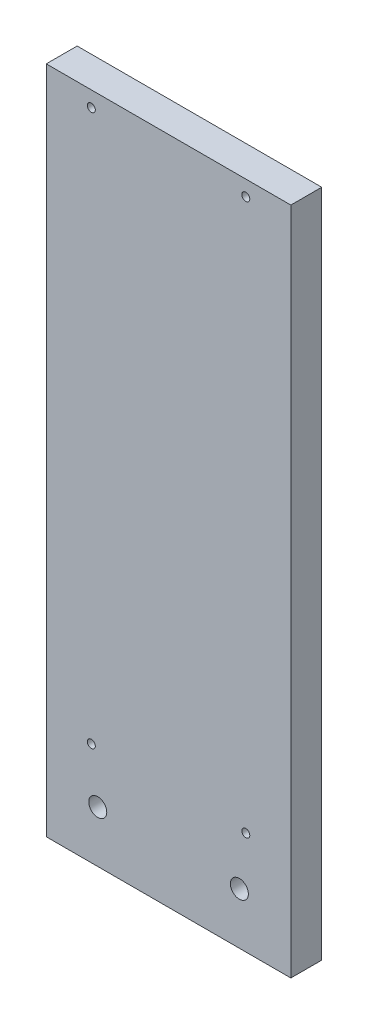
ISO-10303-21;
HEADER;
FILE_DESCRIPTION(('STEP AP214'),'2;1');
FILE_NAME('part.step','',(''),(''),'','','');
FILE_SCHEMA(('AUTOMOTIVE_DESIGN { 1 0 10303 214 1 1 1 1 }'));
ENDSEC;
DATA;
#1=APPLICATION_CONTEXT('core data for automotive mechanical design processes');
#2=APPLICATION_PROTOCOL_DEFINITION('international standard','automotive_design',2000,#1);
#3=PRODUCT_CONTEXT('',#1,'mechanical');
#4=PRODUCT('Part','Part','',(#3));
#5=PRODUCT_RELATED_PRODUCT_CATEGORY('part','',(#4));
#6=PRODUCT_DEFINITION_FORMATION('','',#4);
#7=PRODUCT_DEFINITION_CONTEXT('part definition',#1,'design');
#8=PRODUCT_DEFINITION('design','',#6,#7);
#9=PRODUCT_DEFINITION_SHAPE('','',#8);
#10=(LENGTH_UNIT() NAMED_UNIT(*) SI_UNIT(.MILLI.,.METRE.));
#11=(NAMED_UNIT(*) PLANE_ANGLE_UNIT() SI_UNIT($,.RADIAN.));
#12=(NAMED_UNIT(*) SI_UNIT($,.STERADIAN.) SOLID_ANGLE_UNIT());
#13=UNCERTAINTY_MEASURE_WITH_UNIT(LENGTH_MEASURE(1.E-05),#10,'distance_accuracy_value','');
#14=(GEOMETRIC_REPRESENTATION_CONTEXT(3) GLOBAL_UNCERTAINTY_ASSIGNED_CONTEXT((#13)) GLOBAL_UNIT_ASSIGNED_CONTEXT((#10,
#11,#12)) REPRESENTATION_CONTEXT('',''));
#15=CARTESIAN_POINT('',(0.,0.,0.));
#16=DIRECTION('',(0.,0.,1.));
#17=DIRECTION('',(1.,0.,0.));
#18=AXIS2_PLACEMENT_3D('',#15,#16,#17);
#19=CARTESIAN_POINT('',(47.5,130.,12.));
#20=DIRECTION('',(-1.,0.,0.));
#21=DIRECTION('',(0.,-1.,0.));
#22=AXIS2_PLACEMENT_3D('',#19,#20,#21);
#23=PLANE('',#22);
#24=DIRECTION('',(0.,1.,0.));
#25=VECTOR('',#24,1.);
#26=CARTESIAN_POINT('',(47.5,130.,0.));
#27=LINE('',#26,#25);
#28=CARTESIAN_POINT('',(47.5,-130.,0.));
#29=VERTEX_POINT('',#28);
#30=CARTESIAN_POINT('',(47.5,130.,0.));
#31=VERTEX_POINT('',#30);
#32=EDGE_CURVE('E96',#29,#31,#27,.T.);
#33=ORIENTED_EDGE('',*,*,#32,.T.);
#34=DIRECTION('',(0.,0.,-1.));
#35=VECTOR('',#34,1.);
#36=CARTESIAN_POINT('',(47.5,130.,12.));
#37=LINE('',#36,#35);
#38=CARTESIAN_POINT('',(47.5,130.,12.));
#39=VERTEX_POINT('',#38);
#40=EDGE_CURVE('E11',#39,#31,#37,.T.);
#41=ORIENTED_EDGE('',*,*,#40,.F.);
#42=DIRECTION('',(0.,1.,0.));
#43=VECTOR('',#42,1.);
#44=CARTESIAN_POINT('',(47.5,130.,12.));
#45=LINE('',#44,#43);
#46=CARTESIAN_POINT('',(47.5,-130.,12.));
#47=VERTEX_POINT('',#46);
#48=EDGE_CURVE('E84',#47,#39,#45,.T.);
#49=ORIENTED_EDGE('',*,*,#48,.F.);
#50=DIRECTION('',(0.,0.,-1.));
#51=VECTOR('',#50,1.);
#52=CARTESIAN_POINT('',(47.5,-130.,12.));
#53=LINE('',#52,#51);
#54=EDGE_CURVE('E92',#47,#29,#53,.T.);
#55=ORIENTED_EDGE('',*,*,#54,.T.);
#56=EDGE_LOOP('',(#33,#41,#49,#55));
#57=FACE_BOUND('',#56,.T.);
#58=ADVANCED_FACE('F33',(#57),#23,.F.);
#59=CARTESIAN_POINT('',(-47.5,130.,12.));
#60=DIRECTION('',(0.,-1.,0.));
#61=DIRECTION('',(0.,0.,-1.));
#62=AXIS2_PLACEMENT_3D('',#59,#60,#61);
#63=PLANE('',#62);
#64=DIRECTION('',(-1.,0.,0.));
#65=VECTOR('',#64,1.);
#66=CARTESIAN_POINT('',(-47.5,130.,0.));
#67=LINE('',#66,#65);
#68=CARTESIAN_POINT('',(-47.5,130.,0.));
#69=VERTEX_POINT('',#68);
#70=EDGE_CURVE('E88',#31,#69,#67,.T.);
#71=ORIENTED_EDGE('',*,*,#70,.T.);
#72=DIRECTION('',(0.,0.,-1.));
#73=VECTOR('',#72,1.);
#74=CARTESIAN_POINT('',(-47.5,130.,12.));
#75=LINE('',#74,#73);
#76=CARTESIAN_POINT('',(-47.5,130.,12.));
#77=VERTEX_POINT('',#76);
#78=EDGE_CURVE('E41',#77,#69,#75,.T.);
#79=ORIENTED_EDGE('',*,*,#78,.F.);
#80=DIRECTION('',(-1.,0.,0.));
#81=VECTOR('',#80,1.);
#82=CARTESIAN_POINT('',(-47.5,130.,12.));
#83=LINE('',#82,#81);
#84=EDGE_CURVE('E79',#39,#77,#83,.T.);
#85=ORIENTED_EDGE('',*,*,#84,.F.);
#86=ORIENTED_EDGE('',*,*,#40,.T.);
#87=EDGE_LOOP('',(#71,#79,#85,#86));
#88=FACE_BOUND('',#87,.T.);
#89=ADVANCED_FACE('F87',(#88),#63,.F.);
#90=CARTESIAN_POINT('',(-47.5,130.,12.));
#91=DIRECTION('',(1.,0.,0.));
#92=DIRECTION('',(0.,1.,0.));
#93=AXIS2_PLACEMENT_3D('',#90,#91,#92);
#94=PLANE('',#93);
#95=DIRECTION('',(0.,-1.,0.));
#96=VECTOR('',#95,1.);
#97=CARTESIAN_POINT('',(-47.5,130.,0.));
#98=LINE('',#97,#96);
#99=CARTESIAN_POINT('',(-47.5,-130.,0.));
#100=VERTEX_POINT('',#99);
#101=EDGE_CURVE('E66',#69,#100,#98,.T.);
#102=ORIENTED_EDGE('',*,*,#101,.T.);
#103=DIRECTION('',(0.,0.,-1.));
#104=VECTOR('',#103,1.);
#105=CARTESIAN_POINT('',(-47.5,-130.,12.));
#106=LINE('',#105,#104);
#107=CARTESIAN_POINT('',(-47.5,-130.,12.));
#108=VERTEX_POINT('',#107);
#109=EDGE_CURVE('E89',#108,#100,#106,.T.);
#110=ORIENTED_EDGE('',*,*,#109,.F.);
#111=DIRECTION('',(0.,-1.,0.));
#112=VECTOR('',#111,1.);
#113=CARTESIAN_POINT('',(-47.5,130.,12.));
#114=LINE('',#113,#112);
#115=EDGE_CURVE('E82',#77,#108,#114,.T.);
#116=ORIENTED_EDGE('',*,*,#115,.F.);
#117=ORIENTED_EDGE('',*,*,#78,.T.);
#118=EDGE_LOOP('',(#102,#110,#116,#117));
#119=FACE_BOUND('',#118,.T.);
#120=ADVANCED_FACE('F90',(#119),#94,.F.);
#121=CARTESIAN_POINT('',(-47.5,-130.,12.));
#122=DIRECTION('',(0.,1.,0.));
#123=DIRECTION('',(0.,0.,1.));
#124=AXIS2_PLACEMENT_3D('',#121,#122,#123);
#125=PLANE('',#124);
#126=DIRECTION('',(1.,0.,0.));
#127=VECTOR('',#126,1.);
#128=CARTESIAN_POINT('',(-47.5,-130.,0.));
#129=LINE('',#128,#127);
#130=EDGE_CURVE('E72',#100,#29,#129,.T.);
#131=ORIENTED_EDGE('',*,*,#130,.T.);
#132=ORIENTED_EDGE('',*,*,#54,.F.);
#133=DIRECTION('',(1.,0.,0.));
#134=VECTOR('',#133,1.);
#135=CARTESIAN_POINT('',(-47.5,-130.,12.));
#136=LINE('',#135,#134);
#137=EDGE_CURVE('E49',#108,#47,#136,.T.);
#138=ORIENTED_EDGE('',*,*,#137,.F.);
#139=ORIENTED_EDGE('',*,*,#109,.T.);
#140=EDGE_LOOP('',(#131,#132,#138,#139));
#141=FACE_BOUND('',#140,.T.);
#142=ADVANCED_FACE('F104',(#141),#125,.F.);
#143=CARTESIAN_POINT('',(0.,0.,12.));
#144=DIRECTION('',(0.,0.,1.));
#145=DIRECTION('',(1.,0.,0.));
#146=AXIS2_PLACEMENT_3D('',#143,#144,#145);
#147=PLANE('',#146);
#148=CARTESIAN_POINT('',(-30.,124.,12.));
#149=DIRECTION('',(0.,0.,1.));
#150=DIRECTION('',(1.,0.,0.));
#151=AXIS2_PLACEMENT_3D('',#148,#149,#150);
#152=CIRCLE('',#151,1.55);
#153=CARTESIAN_POINT('',(-28.45,124.,12.));
#154=VERTEX_POINT('',#153);
#155=EDGE_CURVE('E140',#154,#154,#152,.T.);
#156=ORIENTED_EDGE('',*,*,#155,.F.);
#157=EDGE_LOOP('',(#156));
#158=FACE_BOUND('',#157,.T.);
#159=CARTESIAN_POINT('',(30.0000000000001,124.,12.));
#160=DIRECTION('',(0.,0.,1.));
#161=DIRECTION('',(1.,0.,0.));
#162=AXIS2_PLACEMENT_3D('',#159,#160,#161);
#163=CIRCLE('',#162,1.55);
#164=CARTESIAN_POINT('',(31.5500000000001,124.,12.));
#165=VERTEX_POINT('',#164);
#166=EDGE_CURVE('E134',#165,#165,#163,.T.);
#167=ORIENTED_EDGE('',*,*,#166,.F.);
#168=EDGE_LOOP('',(#167));
#169=FACE_BOUND('',#168,.T.);
#170=CARTESIAN_POINT('',(30.,-90.,12.));
#171=DIRECTION('',(0.,0.,1.));
#172=DIRECTION('',(1.,0.,0.));
#173=AXIS2_PLACEMENT_3D('',#170,#171,#172);
#174=CIRCLE('',#173,1.54999999999999);
#175=CARTESIAN_POINT('',(31.55,-90.,12.));
#176=VERTEX_POINT('',#175);
#177=EDGE_CURVE('E128',#176,#176,#174,.T.);
#178=ORIENTED_EDGE('',*,*,#177,.F.);
#179=EDGE_LOOP('',(#178));
#180=FACE_BOUND('',#179,.T.);
#181=CARTESIAN_POINT('',(-30.,-90.,12.));
#182=DIRECTION('',(0.,0.,1.));
#183=DIRECTION('',(1.,0.,0.));
#184=AXIS2_PLACEMENT_3D('',#181,#182,#183);
#185=CIRCLE('',#184,1.55);
#186=CARTESIAN_POINT('',(-28.45,-90.,12.));
#187=VERTEX_POINT('',#186);
#188=EDGE_CURVE('E122',#187,#187,#185,.T.);
#189=ORIENTED_EDGE('',*,*,#188,.F.);
#190=EDGE_LOOP('',(#189));
#191=FACE_BOUND('',#190,.T.);
#192=CARTESIAN_POINT('',(27.5,-110.,12.));
#193=DIRECTION('',(0.,0.,1.));
#194=DIRECTION('',(1.,0.,0.));
#195=AXIS2_PLACEMENT_3D('',#192,#193,#194);
#196=CIRCLE('',#195,3.5);
#197=CARTESIAN_POINT('',(31.,-110.,12.));
#198=VERTEX_POINT('',#197);
#199=EDGE_CURVE('E116',#198,#198,#196,.T.);
#200=ORIENTED_EDGE('',*,*,#199,.F.);
#201=EDGE_LOOP('',(#200));
#202=FACE_BOUND('',#201,.T.);
#203=CARTESIAN_POINT('',(-27.5,-110.,12.));
#204=DIRECTION('',(0.,0.,1.));
#205=DIRECTION('',(1.,0.,0.));
#206=AXIS2_PLACEMENT_3D('',#203,#204,#205);
#207=CIRCLE('',#206,3.5);
#208=CARTESIAN_POINT('',(-24.,-110.,12.));
#209=VERTEX_POINT('',#208);
#210=EDGE_CURVE('E110',#209,#209,#207,.T.);
#211=ORIENTED_EDGE('',*,*,#210,.F.);
#212=EDGE_LOOP('',(#211));
#213=FACE_BOUND('',#212,.T.);
#214=ORIENTED_EDGE('',*,*,#48,.T.);
#215=ORIENTED_EDGE('',*,*,#84,.T.);
#216=ORIENTED_EDGE('',*,*,#115,.T.);
#217=ORIENTED_EDGE('',*,*,#137,.T.);
#218=EDGE_LOOP('',(#214,#215,#216,#217));
#219=FACE_BOUND('',#218,.T.);
#220=ADVANCED_FACE('F80',(#158,#169,#180,#191,#202,#213,#219),#147,.T.);
#221=CARTESIAN_POINT('',(0.,0.,0.));
#222=DIRECTION('',(0.,0.,1.));
#223=DIRECTION('',(1.,0.,0.));
#224=AXIS2_PLACEMENT_3D('',#221,#222,#223);
#225=PLANE('',#224);
#226=CARTESIAN_POINT('',(-30.,124.,0.));
#227=DIRECTION('',(0.,0.,1.));
#228=DIRECTION('',(1.,0.,0.));
#229=AXIS2_PLACEMENT_3D('',#226,#227,#228);
#230=CIRCLE('',#229,1.55);
#231=CARTESIAN_POINT('',(-28.45,124.,0.));
#232=VERTEX_POINT('',#231);
#233=EDGE_CURVE('E137',#232,#232,#230,.T.);
#234=ORIENTED_EDGE('',*,*,#233,.T.);
#235=EDGE_LOOP('',(#234));
#236=FACE_BOUND('',#235,.T.);
#237=CARTESIAN_POINT('',(30.0000000000001,124.,0.));
#238=DIRECTION('',(0.,0.,1.));
#239=DIRECTION('',(1.,0.,0.));
#240=AXIS2_PLACEMENT_3D('',#237,#238,#239);
#241=CIRCLE('',#240,1.55);
#242=CARTESIAN_POINT('',(31.5500000000001,124.,0.));
#243=VERTEX_POINT('',#242);
#244=EDGE_CURVE('E131',#243,#243,#241,.T.);
#245=ORIENTED_EDGE('',*,*,#244,.T.);
#246=EDGE_LOOP('',(#245));
#247=FACE_BOUND('',#246,.T.);
#248=CARTESIAN_POINT('',(30.,-90.,0.));
#249=DIRECTION('',(0.,0.,1.));
#250=DIRECTION('',(1.,0.,0.));
#251=AXIS2_PLACEMENT_3D('',#248,#249,#250);
#252=CIRCLE('',#251,1.54999999999999);
#253=CARTESIAN_POINT('',(31.55,-90.,0.));
#254=VERTEX_POINT('',#253);
#255=EDGE_CURVE('E125',#254,#254,#252,.T.);
#256=ORIENTED_EDGE('',*,*,#255,.T.);
#257=EDGE_LOOP('',(#256));
#258=FACE_BOUND('',#257,.T.);
#259=CARTESIAN_POINT('',(-30.,-90.,0.));
#260=DIRECTION('',(0.,0.,1.));
#261=DIRECTION('',(1.,0.,0.));
#262=AXIS2_PLACEMENT_3D('',#259,#260,#261);
#263=CIRCLE('',#262,1.55);
#264=CARTESIAN_POINT('',(-28.45,-90.,0.));
#265=VERTEX_POINT('',#264);
#266=EDGE_CURVE('E119',#265,#265,#263,.T.);
#267=ORIENTED_EDGE('',*,*,#266,.T.);
#268=EDGE_LOOP('',(#267));
#269=FACE_BOUND('',#268,.T.);
#270=CARTESIAN_POINT('',(27.5,-110.,0.));
#271=DIRECTION('',(0.,0.,1.));
#272=DIRECTION('',(1.,0.,0.));
#273=AXIS2_PLACEMENT_3D('',#270,#271,#272);
#274=CIRCLE('',#273,3.5);
#275=CARTESIAN_POINT('',(31.,-110.,0.));
#276=VERTEX_POINT('',#275);
#277=EDGE_CURVE('E113',#276,#276,#274,.T.);
#278=ORIENTED_EDGE('',*,*,#277,.T.);
#279=EDGE_LOOP('',(#278));
#280=FACE_BOUND('',#279,.T.);
#281=CARTESIAN_POINT('',(-27.5,-110.,0.));
#282=DIRECTION('',(0.,0.,1.));
#283=DIRECTION('',(1.,0.,0.));
#284=AXIS2_PLACEMENT_3D('',#281,#282,#283);
#285=CIRCLE('',#284,3.5);
#286=CARTESIAN_POINT('',(-24.,-110.,0.));
#287=VERTEX_POINT('',#286);
#288=EDGE_CURVE('E99',#287,#287,#285,.T.);
#289=ORIENTED_EDGE('',*,*,#288,.T.);
#290=EDGE_LOOP('',(#289));
#291=FACE_BOUND('',#290,.T.);
#292=ORIENTED_EDGE('',*,*,#32,.F.);
#293=ORIENTED_EDGE('',*,*,#130,.F.);
#294=ORIENTED_EDGE('',*,*,#101,.F.);
#295=ORIENTED_EDGE('',*,*,#70,.F.);
#296=EDGE_LOOP('',(#292,#293,#294,#295));
#297=FACE_BOUND('',#296,.T.);
#298=ADVANCED_FACE('F107',(#236,#247,#258,#269,#280,#291,#297),#225,.F.);
#299=CARTESIAN_POINT('',(-27.5,-110.,0.));
#300=DIRECTION('',(0.,0.,1.));
#301=DIRECTION('',(1.,0.,0.));
#302=AXIS2_PLACEMENT_3D('',#299,#300,#301);
#303=CYLINDRICAL_SURFACE('',#302,3.5);
#304=ORIENTED_EDGE('',*,*,#288,.F.);
#305=EDGE_LOOP('',(#304));
#306=FACE_BOUND('',#305,.T.);
#307=ORIENTED_EDGE('',*,*,#210,.T.);
#308=EDGE_LOOP('',(#307));
#309=FACE_BOUND('',#308,.T.);
#310=ADVANCED_FACE('F168',(#306,#309),#303,.F.);
#311=CARTESIAN_POINT('',(27.5,-110.,0.));
#312=DIRECTION('',(0.,0.,1.));
#313=DIRECTION('',(1.,0.,0.));
#314=AXIS2_PLACEMENT_3D('',#311,#312,#313);
#315=CYLINDRICAL_SURFACE('',#314,3.5);
#316=ORIENTED_EDGE('',*,*,#277,.F.);
#317=EDGE_LOOP('',(#316));
#318=FACE_BOUND('',#317,.T.);
#319=ORIENTED_EDGE('',*,*,#199,.T.);
#320=EDGE_LOOP('',(#319));
#321=FACE_BOUND('',#320,.T.);
#322=ADVANCED_FACE('F170',(#318,#321),#315,.F.);
#323=CARTESIAN_POINT('',(-30.,-90.,0.));
#324=DIRECTION('',(0.,0.,1.));
#325=DIRECTION('',(1.,0.,0.));
#326=AXIS2_PLACEMENT_3D('',#323,#324,#325);
#327=CYLINDRICAL_SURFACE('',#326,1.55);
#328=ORIENTED_EDGE('',*,*,#266,.F.);
#329=EDGE_LOOP('',(#328));
#330=FACE_BOUND('',#329,.T.);
#331=ORIENTED_EDGE('',*,*,#188,.T.);
#332=EDGE_LOOP('',(#331));
#333=FACE_BOUND('',#332,.T.);
#334=ADVANCED_FACE('F177',(#330,#333),#327,.F.);
#335=CARTESIAN_POINT('',(30.,-90.,0.));
#336=DIRECTION('',(0.,0.,1.));
#337=DIRECTION('',(1.,0.,0.));
#338=AXIS2_PLACEMENT_3D('',#335,#336,#337);
#339=CYLINDRICAL_SURFACE('',#338,1.54999999999999);
#340=ORIENTED_EDGE('',*,*,#255,.F.);
#341=EDGE_LOOP('',(#340));
#342=FACE_BOUND('',#341,.T.);
#343=ORIENTED_EDGE('',*,*,#177,.T.);
#344=EDGE_LOOP('',(#343));
#345=FACE_BOUND('',#344,.T.);
#346=ADVANCED_FACE('F217',(#342,#345),#339,.F.);
#347=CARTESIAN_POINT('',(30.0000000000001,124.,0.));
#348=DIRECTION('',(0.,0.,1.));
#349=DIRECTION('',(1.,0.,0.));
#350=AXIS2_PLACEMENT_3D('',#347,#348,#349);
#351=CYLINDRICAL_SURFACE('',#350,1.55);
#352=ORIENTED_EDGE('',*,*,#244,.F.);
#353=EDGE_LOOP('',(#352));
#354=FACE_BOUND('',#353,.T.);
#355=ORIENTED_EDGE('',*,*,#166,.T.);
#356=EDGE_LOOP('',(#355));
#357=FACE_BOUND('',#356,.T.);
#358=ADVANCED_FACE('F151',(#354,#357),#351,.F.);
#359=CARTESIAN_POINT('',(-30.,124.,0.));
#360=DIRECTION('',(0.,0.,1.));
#361=DIRECTION('',(1.,0.,0.));
#362=AXIS2_PLACEMENT_3D('',#359,#360,#361);
#363=CYLINDRICAL_SURFACE('',#362,1.55);
#364=ORIENTED_EDGE('',*,*,#233,.F.);
#365=EDGE_LOOP('',(#364));
#366=FACE_BOUND('',#365,.T.);
#367=ORIENTED_EDGE('',*,*,#155,.T.);
#368=EDGE_LOOP('',(#367));
#369=FACE_BOUND('',#368,.T.);
#370=ADVANCED_FACE('F148',(#366,#369),#363,.F.);
#371=CLOSED_SHELL('',(#58,#89,#120,#142,#220,#298,#310,#322,#334,#346,#358,#370));
#372=MANIFOLD_SOLID_BREP('B2',#371);
#373=ADVANCED_BREP_SHAPE_REPRESENTATION('',(#18,#372),#14);
#374=SHAPE_DEFINITION_REPRESENTATION(#9,#373);
ENDSEC;
END-ISO-10303-21;
